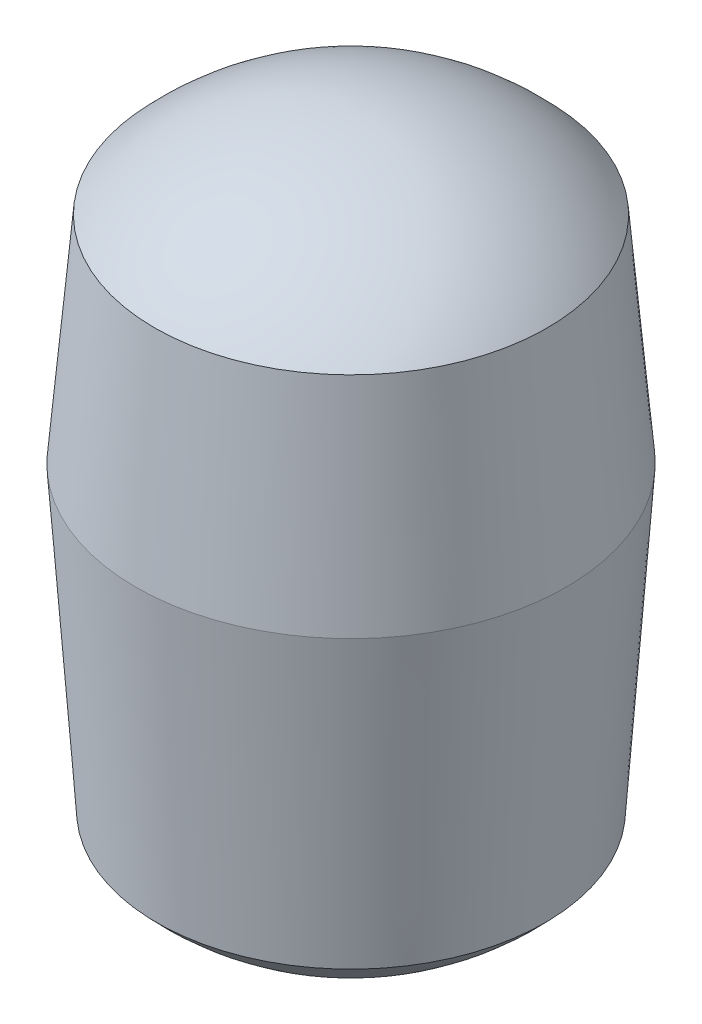
ISO-10303-21;
HEADER;
FILE_DESCRIPTION(('STEP AP214'),'2;1');
FILE_NAME('part.step','',(''),(''),'','','');
FILE_SCHEMA(('AUTOMOTIVE_DESIGN { 1 0 10303 214 1 1 1 1 }'));
ENDSEC;
DATA;
#1=APPLICATION_CONTEXT('core data for automotive mechanical design processes');
#2=APPLICATION_PROTOCOL_DEFINITION('international standard','automotive_design',2000,#1);
#3=PRODUCT_CONTEXT('',#1,'mechanical');
#4=PRODUCT('Part','Part','',(#3));
#5=PRODUCT_RELATED_PRODUCT_CATEGORY('part','',(#4));
#6=PRODUCT_DEFINITION_FORMATION('','',#4);
#7=PRODUCT_DEFINITION_CONTEXT('part definition',#1,'design');
#8=PRODUCT_DEFINITION('design','',#6,#7);
#9=PRODUCT_DEFINITION_SHAPE('','',#8);
#10=(LENGTH_UNIT() NAMED_UNIT(*) SI_UNIT(.MILLI.,.METRE.));
#11=(NAMED_UNIT(*) PLANE_ANGLE_UNIT() SI_UNIT($,.RADIAN.));
#12=(NAMED_UNIT(*) SI_UNIT($,.STERADIAN.) SOLID_ANGLE_UNIT());
#13=UNCERTAINTY_MEASURE_WITH_UNIT(LENGTH_MEASURE(1.E-05),#10,'distance_accuracy_value','');
#14=(GEOMETRIC_REPRESENTATION_CONTEXT(3) GLOBAL_UNCERTAINTY_ASSIGNED_CONTEXT((#13)) GLOBAL_UNIT_ASSIGNED_CONTEXT((#10,
#11,#12)) REPRESENTATION_CONTEXT('',''));
#15=CARTESIAN_POINT('',(0.,0.,0.));
#16=DIRECTION('',(0.,0.,1.));
#17=DIRECTION('',(1.,0.,0.));
#18=AXIS2_PLACEMENT_3D('',#15,#16,#17);
#19=CARTESIAN_POINT('',(0.,0.,0.));
#20=DIRECTION('',(0.,-1.,0.));
#21=DIRECTION('',(0.,0.,1.));
#22=AXIS2_PLACEMENT_3D('',#19,#20,#21);
#23=CONICAL_SURFACE('',#22,0.5,0.0872664625997165);
#24=CARTESIAN_POINT('',(0.,0.5,0.));
#25=DIRECTION('',(0.,1.,0.));
#26=DIRECTION('',(0.,0.,1.));
#27=AXIS2_PLACEMENT_3D('',#24,#25,#26);
#28=CIRCLE('',#27,0.456255668237038);
#29=CARTESIAN_POINT('',(0.,0.5,0.456255668237038));
#30=VERTEX_POINT('',#29);
#31=EDGE_CURVE('E10',#30,#30,#28,.T.);
#32=ORIENTED_EDGE('',*,*,#31,.F.);
#33=EDGE_LOOP('',(#32));
#34=FACE_BOUND('',#33,.T.);
#35=CARTESIAN_POINT('',(0.,0.,0.));
#36=DIRECTION('',(0.,-1.,0.));
#37=DIRECTION('',(0.,0.,-1.));
#38=AXIS2_PLACEMENT_3D('',#35,#36,#37);
#39=CIRCLE('',#38,0.5);
#40=CARTESIAN_POINT('',(0.,0.,-0.5));
#41=VERTEX_POINT('',#40);
#42=EDGE_CURVE('E50',#41,#41,#39,.T.);
#43=ORIENTED_EDGE('',*,*,#42,.F.);
#44=EDGE_LOOP('',(#43));
#45=FACE_BOUND('',#44,.T.);
#46=ADVANCED_FACE('F37',(#34,#45),#23,.T.);
#47=CARTESIAN_POINT('',(0.,0.0795769130039349,0.));
#48=DIRECTION('',(0.,0.,1.));
#49=DIRECTION('',(1.,0.,0.));
#50=AXIS2_PLACEMENT_3D('',#47,#48,#49);
#51=SPHERICAL_SURFACE('',#50,0.620423086996065);
#52=CARTESIAN_POINT('',(0.,0.0795769130039349,0.));
#53=DIRECTION('',(0.,1.,0.));
#54=DIRECTION('',(0.,0.,1.));
#55=AXIS2_PLACEMENT_3D('',#52,#53,#54);
#56=SPHERICAL_SURFACE('',#55,0.620423086996065);
#57=ORIENTED_EDGE('',*,*,#31,.T.);
#58=EDGE_LOOP('',(#57));
#59=FACE_BOUND('',#58,.T.);
#60=ADVANCED_FACE('F59',(#59),#56,.T.);
#61=CARTESIAN_POINT('',(0.,0.,0.));
#62=DIRECTION('',(0.,1.,0.));
#63=DIRECTION('',(0.,0.,-1.));
#64=AXIS2_PLACEMENT_3D('',#61,#62,#63);
#65=CONICAL_SURFACE('',#64,0.5,0.0698131700797732);
#66=CARTESIAN_POINT('',(0.,-0.7,0.));
#67=DIRECTION('',(0.,-1.,0.));
#68=DIRECTION('',(0.,0.,-1.));
#69=AXIS2_PLACEMENT_3D('',#66,#67,#68);
#70=CIRCLE('',#69,0.451051231639543);
#71=CARTESIAN_POINT('',(0.,-0.7,-0.451051231639543));
#72=VERTEX_POINT('',#71);
#73=EDGE_CURVE('E41',#72,#72,#70,.T.);
#74=ORIENTED_EDGE('',*,*,#73,.F.);
#75=EDGE_LOOP('',(#74));
#76=FACE_BOUND('',#75,.T.);
#77=ORIENTED_EDGE('',*,*,#42,.T.);
#78=EDGE_LOOP('',(#77));
#79=FACE_BOUND('',#78,.T.);
#80=ADVANCED_FACE('F56',(#76,#79),#65,.T.);
#81=CARTESIAN_POINT('',(0.,-0.291381966091129,0.));
#82=DIRECTION('',(0.,0.,1.));
#83=DIRECTION('',(1.,0.,0.));
#84=AXIS2_PLACEMENT_3D('',#81,#82,#83);
#85=SPHERICAL_SURFACE('',#84,0.608618033908871);
#86=CARTESIAN_POINT('',(0.,-0.291381966091129,0.));
#87=DIRECTION('',(0.,-1.,0.));
#88=DIRECTION('',(0.,0.,-1.));
#89=AXIS2_PLACEMENT_3D('',#86,#87,#88);
#90=SPHERICAL_SURFACE('',#89,0.608618033908871);
#91=ORIENTED_EDGE('',*,*,#73,.T.);
#92=EDGE_LOOP('',(#91));
#93=FACE_BOUND('',#92,.T.);
#94=ADVANCED_FACE('F39',(#93),#90,.T.);
#95=CLOSED_SHELL('',(#46,#60,#80,#94));
#96=MANIFOLD_SOLID_BREP('B2',#95);
#97=ADVANCED_BREP_SHAPE_REPRESENTATION('',(#18,#96),#14);
#98=SHAPE_DEFINITION_REPRESENTATION(#9,#97);
ENDSEC;
END-ISO-10303-21;
